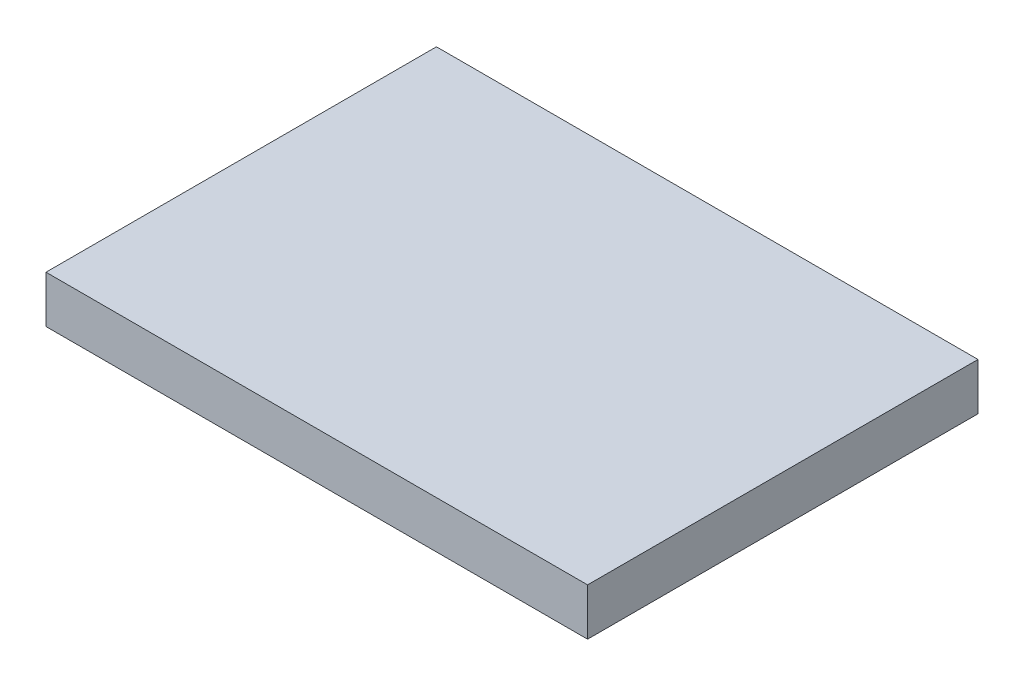
ISO-10303-21;
HEADER;
FILE_DESCRIPTION(('STEP AP214'),'2;1');
FILE_NAME('part.step','',(''),(''),'','','');
FILE_SCHEMA(('AUTOMOTIVE_DESIGN { 1 0 10303 214 1 1 1 1 }'));
ENDSEC;
DATA;
#1=APPLICATION_CONTEXT('core data for automotive mechanical design processes');
#2=APPLICATION_PROTOCOL_DEFINITION('international standard','automotive_design',2000,#1);
#3=PRODUCT_CONTEXT('',#1,'mechanical');
#4=PRODUCT('Part','Part','',(#3));
#5=PRODUCT_RELATED_PRODUCT_CATEGORY('part','',(#4));
#6=PRODUCT_DEFINITION_FORMATION('','',#4);
#7=PRODUCT_DEFINITION_CONTEXT('part definition',#1,'design');
#8=PRODUCT_DEFINITION('design','',#6,#7);
#9=PRODUCT_DEFINITION_SHAPE('','',#8);
#10=(LENGTH_UNIT() NAMED_UNIT(*) SI_UNIT(.MILLI.,.METRE.));
#11=(NAMED_UNIT(*) PLANE_ANGLE_UNIT() SI_UNIT($,.RADIAN.));
#12=(NAMED_UNIT(*) SI_UNIT($,.STERADIAN.) SOLID_ANGLE_UNIT());
#13=UNCERTAINTY_MEASURE_WITH_UNIT(LENGTH_MEASURE(1.E-05),#10,'distance_accuracy_value','');
#14=(GEOMETRIC_REPRESENTATION_CONTEXT(3) GLOBAL_UNCERTAINTY_ASSIGNED_CONTEXT((#13)) GLOBAL_UNIT_ASSIGNED_CONTEXT((#10,
#11,#12)) REPRESENTATION_CONTEXT('',''));
#15=CARTESIAN_POINT('',(0.,0.,0.));
#16=DIRECTION('',(0.,0.,1.));
#17=DIRECTION('',(1.,0.,0.));
#18=AXIS2_PLACEMENT_3D('',#15,#16,#17);
#19=CARTESIAN_POINT('',(0.,4.7625,0.));
#20=DIRECTION('',(1.,0.,0.));
#21=DIRECTION('',(0.,0.,-1.));
#22=AXIS2_PLACEMENT_3D('',#19,#20,#21);
#23=PLANE('',#22);
#24=DIRECTION('',(0.,0.,1.));
#25=VECTOR('',#24,1.);
#26=CARTESIAN_POINT('',(0.,0.,0.));
#27=LINE('',#26,#25);
#28=CARTESIAN_POINT('',(0.,0.,-39.5080982621966));
#29=VERTEX_POINT('',#28);
#30=CARTESIAN_POINT('',(0.,0.,0.));
#31=VERTEX_POINT('',#30);
#32=EDGE_CURVE('E98',#29,#31,#27,.T.);
#33=ORIENTED_EDGE('',*,*,#32,.T.);
#34=DIRECTION('',(0.,-1.,0.));
#35=VECTOR('',#34,1.);
#36=CARTESIAN_POINT('',(0.,4.7625,0.));
#37=LINE('',#36,#35);
#38=CARTESIAN_POINT('',(0.,4.7625,0.));
#39=VERTEX_POINT('',#38);
#40=EDGE_CURVE('E11',#39,#31,#37,.T.);
#41=ORIENTED_EDGE('',*,*,#40,.F.);
#42=DIRECTION('',(0.,0.,1.));
#43=VECTOR('',#42,1.);
#44=CARTESIAN_POINT('',(0.,4.7625,0.));
#45=LINE('',#44,#43);
#46=CARTESIAN_POINT('',(0.,4.7625,-39.5080982621966));
#47=VERTEX_POINT('',#46);
#48=EDGE_CURVE('E86',#47,#39,#45,.T.);
#49=ORIENTED_EDGE('',*,*,#48,.F.);
#50=DIRECTION('',(0.,-1.,0.));
#51=VECTOR('',#50,1.);
#52=CARTESIAN_POINT('',(0.,4.7625,-39.5080982621966));
#53=LINE('',#52,#51);
#54=EDGE_CURVE('E94',#47,#29,#53,.T.);
#55=ORIENTED_EDGE('',*,*,#54,.T.);
#56=EDGE_LOOP('',(#33,#41,#49,#55));
#57=FACE_BOUND('',#56,.T.);
#58=ADVANCED_FACE('F35',(#57),#23,.F.);
#59=CARTESIAN_POINT('',(0.,4.7625,0.));
#60=DIRECTION('',(0.,0.,-1.));
#61=DIRECTION('',(-1.,0.,0.));
#62=AXIS2_PLACEMENT_3D('',#59,#60,#61);
#63=PLANE('',#62);
#64=DIRECTION('',(1.,0.,0.));
#65=VECTOR('',#64,1.);
#66=CARTESIAN_POINT('',(0.,0.,0.));
#67=LINE('',#66,#65);
#68=CARTESIAN_POINT('',(54.8015556540147,0.,0.));
#69=VERTEX_POINT('',#68);
#70=EDGE_CURVE('E90',#31,#69,#67,.T.);
#71=ORIENTED_EDGE('',*,*,#70,.T.);
#72=DIRECTION('',(0.,-1.,0.));
#73=VECTOR('',#72,1.);
#74=CARTESIAN_POINT('',(54.8015556540147,4.7625,0.));
#75=LINE('',#74,#73);
#76=CARTESIAN_POINT('',(54.8015556540147,4.7625,0.));
#77=VERTEX_POINT('',#76);
#78=EDGE_CURVE('E43',#77,#69,#75,.T.);
#79=ORIENTED_EDGE('',*,*,#78,.F.);
#80=DIRECTION('',(1.,0.,0.));
#81=VECTOR('',#80,1.);
#82=CARTESIAN_POINT('',(0.,4.7625,0.));
#83=LINE('',#82,#81);
#84=EDGE_CURVE('E81',#39,#77,#83,.T.);
#85=ORIENTED_EDGE('',*,*,#84,.F.);
#86=ORIENTED_EDGE('',*,*,#40,.T.);
#87=EDGE_LOOP('',(#71,#79,#85,#86));
#88=FACE_BOUND('',#87,.T.);
#89=ADVANCED_FACE('F89',(#88),#63,.F.);
#90=CARTESIAN_POINT('',(54.8015556540147,4.7625,0.));
#91=DIRECTION('',(-1.,0.,0.));
#92=DIRECTION('',(0.,0.,1.));
#93=AXIS2_PLACEMENT_3D('',#90,#91,#92);
#94=PLANE('',#93);
#95=DIRECTION('',(0.,0.,-1.));
#96=VECTOR('',#95,1.);
#97=CARTESIAN_POINT('',(54.8015556540147,0.,0.));
#98=LINE('',#97,#96);
#99=CARTESIAN_POINT('',(54.8015556540147,0.,-39.5080982621966));
#100=VERTEX_POINT('',#99);
#101=EDGE_CURVE('E68',#69,#100,#98,.T.);
#102=ORIENTED_EDGE('',*,*,#101,.T.);
#103=DIRECTION('',(0.,-1.,0.));
#104=VECTOR('',#103,1.);
#105=CARTESIAN_POINT('',(54.8015556540147,4.7625,-39.5080982621966));
#106=LINE('',#105,#104);
#107=CARTESIAN_POINT('',(54.8015556540147,4.7625,-39.5080982621966));
#108=VERTEX_POINT('',#107);
#109=EDGE_CURVE('E91',#108,#100,#106,.T.);
#110=ORIENTED_EDGE('',*,*,#109,.F.);
#111=DIRECTION('',(0.,0.,-1.));
#112=VECTOR('',#111,1.);
#113=CARTESIAN_POINT('',(54.8015556540147,4.7625,0.));
#114=LINE('',#113,#112);
#115=EDGE_CURVE('E84',#77,#108,#114,.T.);
#116=ORIENTED_EDGE('',*,*,#115,.F.);
#117=ORIENTED_EDGE('',*,*,#78,.T.);
#118=EDGE_LOOP('',(#102,#110,#116,#117));
#119=FACE_BOUND('',#118,.T.);
#120=ADVANCED_FACE('F92',(#119),#94,.F.);
#121=CARTESIAN_POINT('',(0.,4.7625,-39.5080982621966));
#122=DIRECTION('',(0.,0.,1.));
#123=DIRECTION('',(1.,0.,0.));
#124=AXIS2_PLACEMENT_3D('',#121,#122,#123);
#125=PLANE('',#124);
#126=DIRECTION('',(-1.,0.,0.));
#127=VECTOR('',#126,1.);
#128=CARTESIAN_POINT('',(0.,0.,-39.5080982621966));
#129=LINE('',#128,#127);
#130=EDGE_CURVE('E74',#100,#29,#129,.T.);
#131=ORIENTED_EDGE('',*,*,#130,.T.);
#132=ORIENTED_EDGE('',*,*,#54,.F.);
#133=DIRECTION('',(-1.,0.,0.));
#134=VECTOR('',#133,1.);
#135=CARTESIAN_POINT('',(0.,4.7625,-39.5080982621966));
#136=LINE('',#135,#134);
#137=EDGE_CURVE('E51',#108,#47,#136,.T.);
#138=ORIENTED_EDGE('',*,*,#137,.F.);
#139=ORIENTED_EDGE('',*,*,#109,.T.);
#140=EDGE_LOOP('',(#131,#132,#138,#139));
#141=FACE_BOUND('',#140,.T.);
#142=ADVANCED_FACE('F105',(#141),#125,.F.);
#143=CARTESIAN_POINT('',(0.,4.7625,0.));
#144=DIRECTION('',(0.,-1.,0.));
#145=DIRECTION('',(0.,0.,-1.));
#146=AXIS2_PLACEMENT_3D('',#143,#144,#145);
#147=PLANE('',#146);
#148=ORIENTED_EDGE('',*,*,#48,.T.);
#149=ORIENTED_EDGE('',*,*,#84,.T.);
#150=ORIENTED_EDGE('',*,*,#115,.T.);
#151=ORIENTED_EDGE('',*,*,#137,.T.);
#152=EDGE_LOOP('',(#148,#149,#150,#151));
#153=FACE_BOUND('',#152,.T.);
#154=ADVANCED_FACE('F82',(#153),#147,.F.);
#155=CARTESIAN_POINT('',(0.,0.,0.));
#156=DIRECTION('',(0.,-1.,0.));
#157=DIRECTION('',(0.,0.,-1.));
#158=AXIS2_PLACEMENT_3D('',#155,#156,#157);
#159=PLANE('',#158);
#160=ORIENTED_EDGE('',*,*,#32,.F.);
#161=ORIENTED_EDGE('',*,*,#130,.F.);
#162=ORIENTED_EDGE('',*,*,#101,.F.);
#163=ORIENTED_EDGE('',*,*,#70,.F.);
#164=EDGE_LOOP('',(#160,#161,#162,#163));
#165=FACE_BOUND('',#164,.T.);
#166=ADVANCED_FACE('F108',(#165),#159,.T.);
#167=CLOSED_SHELL('',(#58,#89,#120,#142,#154,#166));
#168=MANIFOLD_SOLID_BREP('B2',#167);
#169=ADVANCED_BREP_SHAPE_REPRESENTATION('',(#18,#168),#14);
#170=SHAPE_DEFINITION_REPRESENTATION(#9,#169);
ENDSEC;
END-ISO-10303-21;
